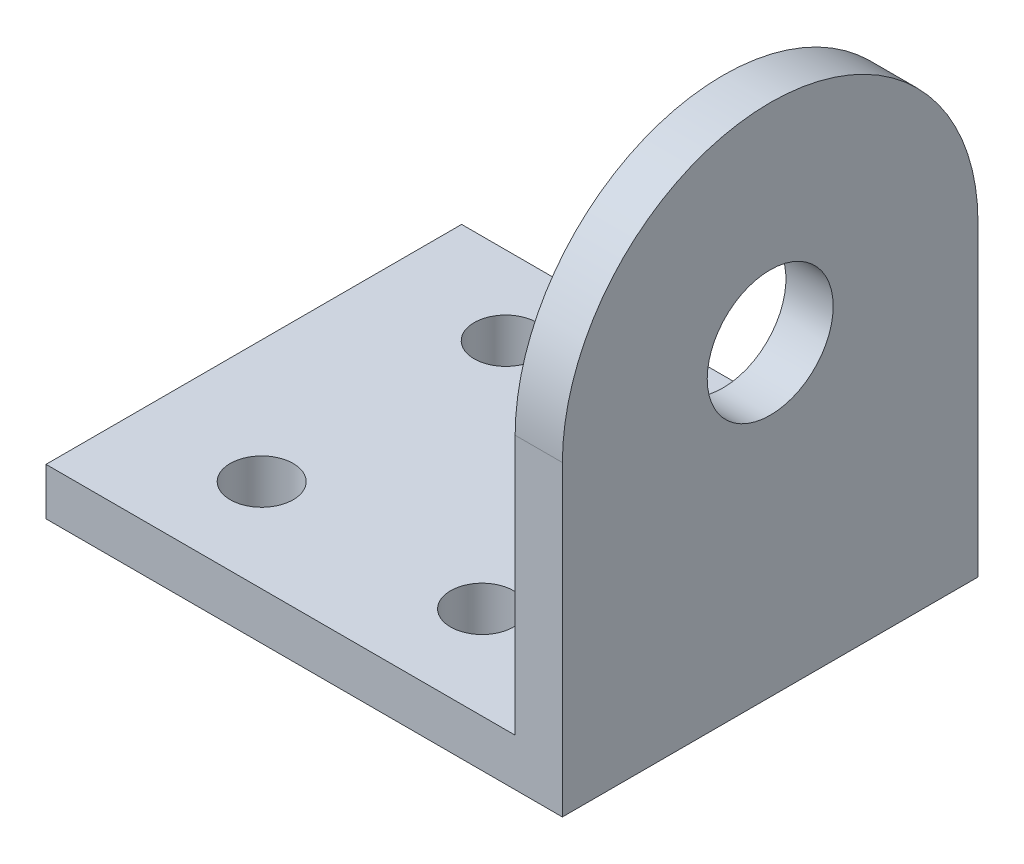
ISO-10303-21;
HEADER;
FILE_DESCRIPTION(('STEP AP214'),'2;1');
FILE_NAME('part.step','',(''),(''),'','','');
FILE_SCHEMA(('AUTOMOTIVE_DESIGN { 1 0 10303 214 1 1 1 1 }'));
ENDSEC;
DATA;
#1=APPLICATION_CONTEXT('core data for automotive mechanical design processes');
#2=APPLICATION_PROTOCOL_DEFINITION('international standard','automotive_design',2000,#1);
#3=PRODUCT_CONTEXT('',#1,'mechanical');
#4=PRODUCT('Part','Part','',(#3));
#5=PRODUCT_RELATED_PRODUCT_CATEGORY('part','',(#4));
#6=PRODUCT_DEFINITION_FORMATION('','',#4);
#7=PRODUCT_DEFINITION_CONTEXT('part definition',#1,'design');
#8=PRODUCT_DEFINITION('design','',#6,#7);
#9=PRODUCT_DEFINITION_SHAPE('','',#8);
#10=(LENGTH_UNIT() NAMED_UNIT(*) SI_UNIT(.MILLI.,.METRE.));
#11=(NAMED_UNIT(*) PLANE_ANGLE_UNIT() SI_UNIT($,.RADIAN.));
#12=(NAMED_UNIT(*) SI_UNIT($,.STERADIAN.) SOLID_ANGLE_UNIT());
#13=UNCERTAINTY_MEASURE_WITH_UNIT(LENGTH_MEASURE(1.E-05),#10,'distance_accuracy_value','');
#14=(GEOMETRIC_REPRESENTATION_CONTEXT(3) GLOBAL_UNCERTAINTY_ASSIGNED_CONTEXT((#13)) GLOBAL_UNIT_ASSIGNED_CONTEXT((#10,
#11,#12)) REPRESENTATION_CONTEXT('',''));
#15=CARTESIAN_POINT('',(0.,0.,0.));
#16=DIRECTION('',(0.,0.,1.));
#17=DIRECTION('',(1.,0.,0.));
#18=AXIS2_PLACEMENT_3D('',#15,#16,#17);
#19=CARTESIAN_POINT('',(-3.,32.7,0.));
#20=DIRECTION('',(1.,0.,0.));
#21=DIRECTION('',(0.,0.,-1.));
#22=AXIS2_PLACEMENT_3D('',#19,#20,#21);
#23=PLANE('',#22);
#24=CARTESIAN_POINT('',(-3.,19.5,0.285443037974677));
#25=DIRECTION('',(-1.,0.,0.));
#26=DIRECTION('',(0.,0.,1.));
#27=AXIS2_PLACEMENT_3D('',#24,#25,#26);
#28=CIRCLE('',#27,4.);
#29=CARTESIAN_POINT('',(-3.,19.5,4.28544303797468));
#30=VERTEX_POINT('',#29);
#31=EDGE_CURVE('E166',#30,#30,#28,.T.);
#32=ORIENTED_EDGE('',*,*,#31,.F.);
#33=EDGE_LOOP('',(#32));
#34=FACE_BOUND('',#33,.T.);
#35=DIRECTION('',(0.,-1.,0.));
#36=VECTOR('',#35,1.);
#37=CARTESIAN_POINT('',(-3.,32.7,13.4854430379747));
#38=LINE('',#37,#36);
#39=CARTESIAN_POINT('',(-3.,19.5,13.4854430379747));
#40=VERTEX_POINT('',#39);
#41=CARTESIAN_POINT('',(-3.,3.,13.4854430379747));
#42=VERTEX_POINT('',#41);
#43=EDGE_CURVE('E51',#40,#42,#38,.T.);
#44=ORIENTED_EDGE('',*,*,#43,.F.);
#45=CARTESIAN_POINT('',(-3.,19.5,0.285443037974677));
#46=DIRECTION('',(-1.,0.,0.));
#47=DIRECTION('',(0.,0.,1.));
#48=AXIS2_PLACEMENT_3D('',#45,#46,#47);
#49=CIRCLE('',#48,13.2);
#50=CARTESIAN_POINT('',(-3.,19.4999999999999,-12.9145569620253));
#51=VERTEX_POINT('',#50);
#52=EDGE_CURVE('E92',#40,#51,#49,.T.);
#53=ORIENTED_EDGE('',*,*,#52,.T.);
#54=DIRECTION('',(0.,-1.,0.));
#55=VECTOR('',#54,1.);
#56=CARTESIAN_POINT('',(-3.,32.7,-12.9145569620253));
#57=LINE('',#56,#55);
#58=CARTESIAN_POINT('',(-3.,3.,-12.9145569620253));
#59=VERTEX_POINT('',#58);
#60=EDGE_CURVE('E103',#51,#59,#57,.T.);
#61=ORIENTED_EDGE('',*,*,#60,.T.);
#62=DIRECTION('',(0.,0.,-1.));
#63=VECTOR('',#62,1.);
#64=CARTESIAN_POINT('',(-3.,3.,-12.9145569620253));
#65=LINE('',#64,#63);
#66=EDGE_CURVE('E101',#42,#59,#65,.T.);
#67=ORIENTED_EDGE('',*,*,#66,.F.);
#68=EDGE_LOOP('',(#44,#53,#61,#67));
#69=FACE_BOUND('',#68,.T.);
#70=ADVANCED_FACE('F36',(#34,#69),#23,.F.);
#71=CARTESIAN_POINT('',(0.,32.7,0.));
#72=DIRECTION('',(1.,0.,0.));
#73=DIRECTION('',(0.,0.,-1.));
#74=AXIS2_PLACEMENT_3D('',#71,#72,#73);
#75=PLANE('',#74);
#76=CARTESIAN_POINT('',(0.,19.5,0.285443037974677));
#77=DIRECTION('',(1.,0.,0.));
#78=DIRECTION('',(0.,0.,-1.));
#79=AXIS2_PLACEMENT_3D('',#76,#77,#78);
#80=CIRCLE('',#79,4.);
#81=CARTESIAN_POINT('',(0.,19.5,-3.71455696202532));
#82=VERTEX_POINT('',#81);
#83=EDGE_CURVE('E40',#82,#82,#80,.T.);
#84=ORIENTED_EDGE('',*,*,#83,.F.);
#85=EDGE_LOOP('',(#84));
#86=FACE_BOUND('',#85,.T.);
#87=CARTESIAN_POINT('',(0.,19.5,0.285443037974677));
#88=DIRECTION('',(1.,0.,0.));
#89=DIRECTION('',(0.,0.,-1.));
#90=AXIS2_PLACEMENT_3D('',#87,#88,#89);
#91=CIRCLE('',#90,13.2);
#92=CARTESIAN_POINT('',(0.,19.4999999999999,-12.9145569620253));
#93=VERTEX_POINT('',#92);
#94=CARTESIAN_POINT('',(0.,19.5,13.4854430379747));
#95=VERTEX_POINT('',#94);
#96=EDGE_CURVE('E116',#93,#95,#91,.T.);
#97=ORIENTED_EDGE('',*,*,#96,.T.);
#98=DIRECTION('',(0.,-1.,0.));
#99=VECTOR('',#98,1.);
#100=CARTESIAN_POINT('',(0.,32.7,13.4854430379747));
#101=LINE('',#100,#99);
#102=CARTESIAN_POINT('',(0.,0.,13.4854430379747));
#103=VERTEX_POINT('',#102);
#104=EDGE_CURVE('E45',#95,#103,#101,.T.);
#105=ORIENTED_EDGE('',*,*,#104,.T.);
#106=DIRECTION('',(0.,0.,1.));
#107=VECTOR('',#106,1.);
#108=CARTESIAN_POINT('',(0.,0.,0.));
#109=LINE('',#108,#107);
#110=CARTESIAN_POINT('',(0.,0.,-12.9145569620253));
#111=VERTEX_POINT('',#110);
#112=EDGE_CURVE('E108',#111,#103,#109,.T.);
#113=ORIENTED_EDGE('',*,*,#112,.F.);
#114=DIRECTION('',(0.,-1.,0.));
#115=VECTOR('',#114,1.);
#116=CARTESIAN_POINT('',(0.,32.7,-12.9145569620253));
#117=LINE('',#116,#115);
#118=EDGE_CURVE('E59',#93,#111,#117,.T.);
#119=ORIENTED_EDGE('',*,*,#118,.F.);
#120=EDGE_LOOP('',(#97,#105,#113,#119));
#121=FACE_BOUND('',#120,.T.);
#122=ADVANCED_FACE('F114',(#86,#121),#75,.T.);
#123=CARTESIAN_POINT('',(0.,32.7,13.4854430379747));
#124=DIRECTION('',(0.,0.,1.));
#125=DIRECTION('',(1.,0.,0.));
#126=AXIS2_PLACEMENT_3D('',#123,#124,#125);
#127=PLANE('',#126);
#128=ORIENTED_EDGE('',*,*,#104,.F.);
#129=DIRECTION('',(-1.,0.,0.));
#130=VECTOR('',#129,1.);
#131=CARTESIAN_POINT('',(9.,19.5,13.4854430379747));
#132=LINE('',#131,#130);
#133=EDGE_CURVE('E11',#95,#40,#132,.T.);
#134=ORIENTED_EDGE('',*,*,#133,.T.);
#135=ORIENTED_EDGE('',*,*,#43,.T.);
#136=DIRECTION('',(1.,0.,0.));
#137=VECTOR('',#136,1.);
#138=CARTESIAN_POINT('',(-32.8,3.,13.4854430379747));
#139=LINE('',#138,#137);
#140=CARTESIAN_POINT('',(-32.8,3.,13.4854430379747));
#141=VERTEX_POINT('',#140);
#142=EDGE_CURVE('E123',#141,#42,#139,.T.);
#143=ORIENTED_EDGE('',*,*,#142,.F.);
#144=DIRECTION('',(0.,1.,0.));
#145=VECTOR('',#144,1.);
#146=CARTESIAN_POINT('',(-32.8,3.,13.4854430379747));
#147=LINE('',#146,#145);
#148=CARTESIAN_POINT('',(-32.8,0.,13.4854430379747));
#149=VERTEX_POINT('',#148);
#150=EDGE_CURVE('E119',#149,#141,#147,.T.);
#151=ORIENTED_EDGE('',*,*,#150,.F.);
#152=DIRECTION('',(-1.,0.,0.));
#153=VECTOR('',#152,1.);
#154=CARTESIAN_POINT('',(0.,0.,13.4854430379747));
#155=LINE('',#154,#153);
#156=EDGE_CURVE('E118',#103,#149,#155,.T.);
#157=ORIENTED_EDGE('',*,*,#156,.F.);
#158=EDGE_LOOP('',(#128,#134,#135,#143,#151,#157));
#159=FACE_BOUND('',#158,.T.);
#160=ADVANCED_FACE('F38',(#159),#127,.T.);
#161=CARTESIAN_POINT('',(0.,32.7,-12.9145569620253));
#162=DIRECTION('',(0.,0.,-1.));
#163=DIRECTION('',(-1.,0.,0.));
#164=AXIS2_PLACEMENT_3D('',#161,#162,#163);
#165=PLANE('',#164);
#166=DIRECTION('',(-1.,0.,0.));
#167=VECTOR('',#166,1.);
#168=CARTESIAN_POINT('',(9.,19.4999999999999,-12.9145569620253));
#169=LINE('',#168,#167);
#170=EDGE_CURVE('E95',#93,#51,#169,.T.);
#171=ORIENTED_EDGE('',*,*,#170,.F.);
#172=ORIENTED_EDGE('',*,*,#118,.T.);
#173=DIRECTION('',(1.,0.,0.));
#174=VECTOR('',#173,1.);
#175=CARTESIAN_POINT('',(0.,0.,-12.9145569620253));
#176=LINE('',#175,#174);
#177=CARTESIAN_POINT('',(-32.8,0.,-12.9145569620253));
#178=VERTEX_POINT('',#177);
#179=EDGE_CURVE('E104',#178,#111,#176,.T.);
#180=ORIENTED_EDGE('',*,*,#179,.F.);
#181=DIRECTION('',(0.,-1.,0.));
#182=VECTOR('',#181,1.);
#183=CARTESIAN_POINT('',(-32.8,0.,-12.9145569620253));
#184=LINE('',#183,#182);
#185=CARTESIAN_POINT('',(-32.8,3.,-12.9145569620253));
#186=VERTEX_POINT('',#185);
#187=EDGE_CURVE('E131',#186,#178,#184,.T.);
#188=ORIENTED_EDGE('',*,*,#187,.F.);
#189=DIRECTION('',(1.,0.,0.));
#190=VECTOR('',#189,1.);
#191=CARTESIAN_POINT('',(-32.8,3.,-12.9145569620253));
#192=LINE('',#191,#190);
#193=EDGE_CURVE('E128',#186,#59,#192,.T.);
#194=ORIENTED_EDGE('',*,*,#193,.T.);
#195=ORIENTED_EDGE('',*,*,#60,.F.);
#196=EDGE_LOOP('',(#171,#172,#180,#188,#194,#195));
#197=FACE_BOUND('',#196,.T.);
#198=ADVANCED_FACE('F180',(#197),#165,.T.);
#199=CARTESIAN_POINT('',(0.,0.,0.));
#200=DIRECTION('',(0.,1.,0.));
#201=DIRECTION('',(0.,0.,1.));
#202=AXIS2_PLACEMENT_3D('',#199,#200,#201);
#203=PLANE('',#202);
#204=CARTESIAN_POINT('',(-25.,0.,7.58544303797468));
#205=DIRECTION('',(0.,1.,0.));
#206=DIRECTION('',(0.,0.,-1.));
#207=AXIS2_PLACEMENT_3D('',#204,#205,#206);
#208=CIRCLE('',#207,2.);
#209=CARTESIAN_POINT('',(-25.,0.,5.58544303797468));
#210=VERTEX_POINT('',#209);
#211=EDGE_CURVE('E150',#210,#210,#208,.T.);
#212=ORIENTED_EDGE('',*,*,#211,.T.);
#213=EDGE_LOOP('',(#212));
#214=FACE_BOUND('',#213,.T.);
#215=CARTESIAN_POINT('',(-11.,0.,-7.91455696202532));
#216=DIRECTION('',(0.,1.,0.));
#217=DIRECTION('',(0.,0.,1.));
#218=AXIS2_PLACEMENT_3D('',#215,#216,#217);
#219=CIRCLE('',#218,2.);
#220=CARTESIAN_POINT('',(-11.,0.,-5.91455696202532));
#221=VERTEX_POINT('',#220);
#222=EDGE_CURVE('E156',#221,#221,#219,.T.);
#223=ORIENTED_EDGE('',*,*,#222,.T.);
#224=EDGE_LOOP('',(#223));
#225=FACE_BOUND('',#224,.T.);
#226=CARTESIAN_POINT('',(-11.,0.,7.58544303797468));
#227=DIRECTION('',(0.,1.,0.));
#228=DIRECTION('',(0.,0.,-1.));
#229=AXIS2_PLACEMENT_3D('',#226,#227,#228);
#230=CIRCLE('',#229,2.);
#231=CARTESIAN_POINT('',(-11.,0.,5.58544303797468));
#232=VERTEX_POINT('',#231);
#233=EDGE_CURVE('E144',#232,#232,#230,.T.);
#234=ORIENTED_EDGE('',*,*,#233,.T.);
#235=EDGE_LOOP('',(#234));
#236=FACE_BOUND('',#235,.T.);
#237=CARTESIAN_POINT('',(-25.,0.,-7.91455696202532));
#238=DIRECTION('',(0.,1.,0.));
#239=DIRECTION('',(0.,0.,1.));
#240=AXIS2_PLACEMENT_3D('',#237,#238,#239);
#241=CIRCLE('',#240,2.);
#242=CARTESIAN_POINT('',(-25.,0.,-5.91455696202531));
#243=VERTEX_POINT('',#242);
#244=EDGE_CURVE('E134',#243,#243,#241,.T.);
#245=ORIENTED_EDGE('',*,*,#244,.T.);
#246=EDGE_LOOP('',(#245));
#247=FACE_BOUND('',#246,.T.);
#248=ORIENTED_EDGE('',*,*,#156,.T.);
#249=DIRECTION('',(0.,0.,1.));
#250=VECTOR('',#249,1.);
#251=CARTESIAN_POINT('',(-32.8,0.,13.4854430379747));
#252=LINE('',#251,#250);
#253=EDGE_CURVE('E133',#178,#149,#252,.T.);
#254=ORIENTED_EDGE('',*,*,#253,.F.);
#255=ORIENTED_EDGE('',*,*,#179,.T.);
#256=ORIENTED_EDGE('',*,*,#112,.T.);
#257=EDGE_LOOP('',(#248,#254,#255,#256));
#258=FACE_BOUND('',#257,.T.);
#259=ADVANCED_FACE('F125',(#214,#225,#236,#247,#258),#203,.F.);
#260=CARTESIAN_POINT('',(-32.8,3.,-12.9145569620253));
#261=DIRECTION('',(0.,-1.,0.));
#262=DIRECTION('',(0.,0.,-1.));
#263=AXIS2_PLACEMENT_3D('',#260,#261,#262);
#264=PLANE('',#263);
#265=CARTESIAN_POINT('',(-25.,3.,7.58544303797468));
#266=DIRECTION('',(0.,1.,0.));
#267=DIRECTION('',(0.,0.,-1.));
#268=AXIS2_PLACEMENT_3D('',#265,#266,#267);
#269=CIRCLE('',#268,2.);
#270=CARTESIAN_POINT('',(-25.,3.,5.58544303797468));
#271=VERTEX_POINT('',#270);
#272=EDGE_CURVE('E147',#271,#271,#269,.T.);
#273=ORIENTED_EDGE('',*,*,#272,.F.);
#274=EDGE_LOOP('',(#273));
#275=FACE_BOUND('',#274,.T.);
#276=CARTESIAN_POINT('',(-11.,3.,-7.91455696202532));
#277=DIRECTION('',(0.,1.,0.));
#278=DIRECTION('',(0.,0.,1.));
#279=AXIS2_PLACEMENT_3D('',#276,#277,#278);
#280=CIRCLE('',#279,2.);
#281=CARTESIAN_POINT('',(-11.,3.,-5.91455696202532));
#282=VERTEX_POINT('',#281);
#283=EDGE_CURVE('E153',#282,#282,#280,.T.);
#284=ORIENTED_EDGE('',*,*,#283,.F.);
#285=EDGE_LOOP('',(#284));
#286=FACE_BOUND('',#285,.T.);
#287=CARTESIAN_POINT('',(-11.,3.,7.58544303797468));
#288=DIRECTION('',(0.,1.,0.));
#289=DIRECTION('',(0.,0.,-1.));
#290=AXIS2_PLACEMENT_3D('',#287,#288,#289);
#291=CIRCLE('',#290,2.);
#292=CARTESIAN_POINT('',(-11.,3.,5.58544303797468));
#293=VERTEX_POINT('',#292);
#294=EDGE_CURVE('E159',#293,#293,#291,.T.);
#295=ORIENTED_EDGE('',*,*,#294,.F.);
#296=EDGE_LOOP('',(#295));
#297=FACE_BOUND('',#296,.T.);
#298=CARTESIAN_POINT('',(-25.,3.,-7.91455696202532));
#299=DIRECTION('',(0.,1.,0.));
#300=DIRECTION('',(0.,0.,1.));
#301=AXIS2_PLACEMENT_3D('',#298,#299,#300);
#302=CIRCLE('',#301,2.);
#303=CARTESIAN_POINT('',(-25.,3.,-5.91455696202531));
#304=VERTEX_POINT('',#303);
#305=EDGE_CURVE('E141',#304,#304,#302,.T.);
#306=ORIENTED_EDGE('',*,*,#305,.F.);
#307=EDGE_LOOP('',(#306));
#308=FACE_BOUND('',#307,.T.);
#309=ORIENTED_EDGE('',*,*,#66,.T.);
#310=ORIENTED_EDGE('',*,*,#193,.F.);
#311=DIRECTION('',(0.,0.,-1.));
#312=VECTOR('',#311,1.);
#313=CARTESIAN_POINT('',(-32.8,3.,-12.9145569620253));
#314=LINE('',#313,#312);
#315=EDGE_CURVE('E137',#141,#186,#314,.T.);
#316=ORIENTED_EDGE('',*,*,#315,.F.);
#317=ORIENTED_EDGE('',*,*,#142,.T.);
#318=EDGE_LOOP('',(#309,#310,#316,#317));
#319=FACE_BOUND('',#318,.T.);
#320=ADVANCED_FACE('F188',(#275,#286,#297,#308,#319),#264,.F.);
#321=CARTESIAN_POINT('',(-32.8,0.,0.));
#322=DIRECTION('',(1.,0.,0.));
#323=DIRECTION('',(0.,0.,-1.));
#324=AXIS2_PLACEMENT_3D('',#321,#322,#323);
#325=PLANE('',#324);
#326=ORIENTED_EDGE('',*,*,#253,.T.);
#327=ORIENTED_EDGE('',*,*,#150,.T.);
#328=ORIENTED_EDGE('',*,*,#315,.T.);
#329=ORIENTED_EDGE('',*,*,#187,.T.);
#330=EDGE_LOOP('',(#326,#327,#328,#329));
#331=FACE_BOUND('',#330,.T.);
#332=ADVANCED_FACE('F192',(#331),#325,.F.);
#333=CARTESIAN_POINT('',(-25.,0.,-7.91455696202532));
#334=DIRECTION('',(0.,1.,0.));
#335=DIRECTION('',(0.,0.,1.));
#336=AXIS2_PLACEMENT_3D('',#333,#334,#335);
#337=CYLINDRICAL_SURFACE('',#336,2.);
#338=ORIENTED_EDGE('',*,*,#244,.F.);
#339=EDGE_LOOP('',(#338));
#340=FACE_BOUND('',#339,.T.);
#341=ORIENTED_EDGE('',*,*,#305,.T.);
#342=EDGE_LOOP('',(#341));
#343=FACE_BOUND('',#342,.T.);
#344=ADVANCED_FACE('F196',(#340,#343),#337,.F.);
#345=CARTESIAN_POINT('',(-11.,0.,7.58544303797468));
#346=DIRECTION('',(0.,1.,0.));
#347=DIRECTION('',(0.,0.,1.));
#348=AXIS2_PLACEMENT_3D('',#345,#346,#347);
#349=CYLINDRICAL_SURFACE('',#348,2.);
#350=ORIENTED_EDGE('',*,*,#233,.F.);
#351=EDGE_LOOP('',(#350));
#352=FACE_BOUND('',#351,.T.);
#353=ORIENTED_EDGE('',*,*,#294,.T.);
#354=EDGE_LOOP('',(#353));
#355=FACE_BOUND('',#354,.T.);
#356=ADVANCED_FACE('F200',(#352,#355),#349,.F.);
#357=CARTESIAN_POINT('',(-11.,0.,-7.91455696202532));
#358=DIRECTION('',(0.,1.,0.));
#359=DIRECTION('',(0.,0.,1.));
#360=AXIS2_PLACEMENT_3D('',#357,#358,#359);
#361=CYLINDRICAL_SURFACE('',#360,2.);
#362=ORIENTED_EDGE('',*,*,#222,.F.);
#363=EDGE_LOOP('',(#362));
#364=FACE_BOUND('',#363,.T.);
#365=ORIENTED_EDGE('',*,*,#283,.T.);
#366=EDGE_LOOP('',(#365));
#367=FACE_BOUND('',#366,.T.);
#368=ADVANCED_FACE('F205',(#364,#367),#361,.F.);
#369=CARTESIAN_POINT('',(-25.,0.,7.58544303797468));
#370=DIRECTION('',(0.,1.,0.));
#371=DIRECTION('',(0.,0.,1.));
#372=AXIS2_PLACEMENT_3D('',#369,#370,#371);
#373=CYLINDRICAL_SURFACE('',#372,2.);
#374=ORIENTED_EDGE('',*,*,#211,.F.);
#375=EDGE_LOOP('',(#374));
#376=FACE_BOUND('',#375,.T.);
#377=ORIENTED_EDGE('',*,*,#272,.T.);
#378=EDGE_LOOP('',(#377));
#379=FACE_BOUND('',#378,.T.);
#380=ADVANCED_FACE('F202',(#376,#379),#373,.F.);
#381=CARTESIAN_POINT('',(9.,19.5,0.285443037974676));
#382=DIRECTION('',(-1.,0.,0.));
#383=DIRECTION('',(0.,0.,1.));
#384=AXIS2_PLACEMENT_3D('',#381,#382,#383);
#385=CYLINDRICAL_SURFACE('',#384,13.2);
#386=ORIENTED_EDGE('',*,*,#170,.T.);
#387=ORIENTED_EDGE('',*,*,#52,.F.);
#388=ORIENTED_EDGE('',*,*,#133,.F.);
#389=ORIENTED_EDGE('',*,*,#96,.F.);
#390=EDGE_LOOP('',(#386,#387,#388,#389));
#391=FACE_BOUND('',#390,.T.);
#392=ADVANCED_FACE('F93',(#391),#385,.T.);
#393=CARTESIAN_POINT('',(9.,19.5,0.285443037974676));
#394=DIRECTION('',(-1.,0.,0.));
#395=DIRECTION('',(0.,0.,1.));
#396=AXIS2_PLACEMENT_3D('',#393,#394,#395);
#397=CYLINDRICAL_SURFACE('',#396,4.);
#398=ORIENTED_EDGE('',*,*,#83,.T.);
#399=EDGE_LOOP('',(#398));
#400=FACE_BOUND('',#399,.T.);
#401=ORIENTED_EDGE('',*,*,#31,.T.);
#402=EDGE_LOOP('',(#401));
#403=FACE_BOUND('',#402,.T.);
#404=ADVANCED_FACE('F173',(#400,#403),#397,.F.);
#405=CLOSED_SHELL('',(#70,#122,#160,#198,#259,#320,#332,#344,#356,#368,#380,#392,#404));
#406=MANIFOLD_SOLID_BREP('B2',#405);
#407=ADVANCED_BREP_SHAPE_REPRESENTATION('',(#18,#406),#14);
#408=SHAPE_DEFINITION_REPRESENTATION(#9,#407);
ENDSEC;
END-ISO-10303-21;
